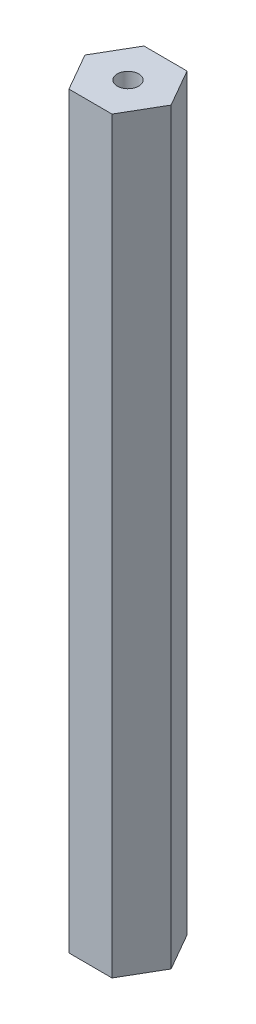
ISO-10303-21;
HEADER;
FILE_DESCRIPTION(('STEP AP214'),'2;1');
FILE_NAME('part.step','',(''),(''),'','','');
FILE_SCHEMA(('AUTOMOTIVE_DESIGN { 1 0 10303 214 1 1 1 1 }'));
ENDSEC;
DATA;
#1=APPLICATION_CONTEXT('core data for automotive mechanical design processes');
#2=APPLICATION_PROTOCOL_DEFINITION('international standard','automotive_design',2000,#1);
#3=PRODUCT_CONTEXT('',#1,'mechanical');
#4=PRODUCT('Part','Part','',(#3));
#5=PRODUCT_RELATED_PRODUCT_CATEGORY('part','',(#4));
#6=PRODUCT_DEFINITION_FORMATION('','',#4);
#7=PRODUCT_DEFINITION_CONTEXT('part definition',#1,'design');
#8=PRODUCT_DEFINITION('design','',#6,#7);
#9=PRODUCT_DEFINITION_SHAPE('','',#8);
#10=(LENGTH_UNIT() NAMED_UNIT(*) SI_UNIT(.MILLI.,.METRE.));
#11=(NAMED_UNIT(*) PLANE_ANGLE_UNIT() SI_UNIT($,.RADIAN.));
#12=(NAMED_UNIT(*) SI_UNIT($,.STERADIAN.) SOLID_ANGLE_UNIT());
#13=UNCERTAINTY_MEASURE_WITH_UNIT(LENGTH_MEASURE(1.E-05),#10,'distance_accuracy_value','');
#14=(GEOMETRIC_REPRESENTATION_CONTEXT(3) GLOBAL_UNCERTAINTY_ASSIGNED_CONTEXT((#13)) GLOBAL_UNIT_ASSIGNED_CONTEXT((#10,
#11,#12)) REPRESENTATION_CONTEXT('',''));
#15=CARTESIAN_POINT('',(0.,0.,0.));
#16=DIRECTION('',(0.,0.,1.));
#17=DIRECTION('',(1.,0.,0.));
#18=AXIS2_PLACEMENT_3D('',#15,#16,#17);
#19=CARTESIAN_POINT('',(0.,88.9,0.));
#20=DIRECTION('',(0.,1.,0.));
#21=DIRECTION('',(0.,0.,1.));
#22=AXIS2_PLACEMENT_3D('',#19,#20,#21);
#23=PLANE('',#22);
#24=DIRECTION('',(0.999994818263822,0.,0.00321923057656727));
#25=VECTOR('',#24,1.);
#26=CARTESIAN_POINT('',(-2.58061812845745,88.9,4.43671538510305));
#27=LINE('',#26,#25);
#28=CARTESIAN_POINT('',(-2.58061812845745,88.9,4.43671538510305));
#29=VERTEX_POINT('',#28);
#30=CARTESIAN_POINT('',(2.55199916863177,88.9,4.45323854926233));
#31=VERTEX_POINT('',#30);
#32=EDGE_CURVE('E146',#29,#31,#27,.T.);
#33=ORIENTED_EDGE('',*,*,#32,.T.);
#34=DIRECTION('',(0.502785344591858,0.,-0.864411300980989));
#35=VECTOR('',#34,1.);
#36=CARTESIAN_POINT('',(2.55199916863177,88.9,4.45323854926233));
#37=LINE('',#36,#35);
#38=CARTESIAN_POINT('',(5.13261729708923,88.9,0.0165231641592834));
#39=VERTEX_POINT('',#38);
#40=EDGE_CURVE('E94',#31,#39,#37,.T.);
#41=ORIENTED_EDGE('',*,*,#40,.T.);
#42=DIRECTION('',(-0.497209473671965,0.,-0.867630531557556));
#43=VECTOR('',#42,1.);
#44=CARTESIAN_POINT('',(5.13261729708923,88.9,0.0165231641592834));
#45=LINE('',#44,#43);
#46=CARTESIAN_POINT('',(2.58061812845745,88.9,-4.43671538510305));
#47=VERTEX_POINT('',#46);
#48=EDGE_CURVE('E107',#39,#47,#45,.T.);
#49=ORIENTED_EDGE('',*,*,#48,.T.);
#50=DIRECTION('',(-0.999994818263822,0.,-0.0032192305765671));
#51=VECTOR('',#50,1.);
#52=CARTESIAN_POINT('',(2.58061812845745,88.9,-4.43671538510305));
#53=LINE('',#52,#51);
#54=CARTESIAN_POINT('',(-2.55199916863177,88.9,-4.45323854926233));
#55=VERTEX_POINT('',#54);
#56=EDGE_CURVE('E101',#47,#55,#53,.T.);
#57=ORIENTED_EDGE('',*,*,#56,.T.);
#58=DIRECTION('',(-0.502785344591858,0.,0.864411300980989));
#59=VECTOR('',#58,1.);
#60=CARTESIAN_POINT('',(-2.55199916863177,88.9,-4.45323854926233));
#61=LINE('',#60,#59);
#62=CARTESIAN_POINT('',(-5.13261729708923,88.9,-0.0165231641592826));
#63=VERTEX_POINT('',#62);
#64=EDGE_CURVE('E105',#55,#63,#61,.T.);
#65=ORIENTED_EDGE('',*,*,#64,.T.);
#66=DIRECTION('',(0.497209473671965,0.,0.867630531557556));
#67=VECTOR('',#66,1.);
#68=CARTESIAN_POINT('',(-5.13261729708923,88.9,-0.0165231641592826));
#69=LINE('',#68,#67);
#70=EDGE_CURVE('E57',#63,#29,#69,.T.);
#71=ORIENTED_EDGE('',*,*,#70,.T.);
#72=EDGE_LOOP('',(#33,#41,#49,#57,#65,#71));
#73=FACE_BOUND('',#72,.T.);
#74=CARTESIAN_POINT('',(0.,88.9,0.));
#75=DIRECTION('',(0.,1.,0.));
#76=DIRECTION('',(0.,0.,1.));
#77=AXIS2_PLACEMENT_3D('',#74,#75,#76);
#78=CIRCLE('',#77,1.27);
#79=CARTESIAN_POINT('',(0.,88.9,1.27));
#80=VERTEX_POINT('',#79);
#81=EDGE_CURVE('E134',#80,#80,#78,.T.);
#82=ORIENTED_EDGE('',*,*,#81,.F.);
#83=EDGE_LOOP('',(#82));
#84=FACE_BOUND('',#83,.T.);
#85=ADVANCED_FACE('F39',(#73,#84),#23,.T.);
#86=CARTESIAN_POINT('',(0.,0.,0.));
#87=DIRECTION('',(0.,1.,0.));
#88=DIRECTION('',(0.,0.,1.));
#89=AXIS2_PLACEMENT_3D('',#86,#87,#88);
#90=PLANE('',#89);
#91=DIRECTION('',(0.999994818263822,0.,0.00321923057656727));
#92=VECTOR('',#91,1.);
#93=CARTESIAN_POINT('',(-2.58061812845745,0.,4.43671538510305));
#94=LINE('',#93,#92);
#95=CARTESIAN_POINT('',(-2.58061812845745,0.,4.43671538510305));
#96=VERTEX_POINT('',#95);
#97=CARTESIAN_POINT('',(2.55199916863177,0.,4.45323854926233));
#98=VERTEX_POINT('',#97);
#99=EDGE_CURVE('E129',#96,#98,#94,.T.);
#100=ORIENTED_EDGE('',*,*,#99,.F.);
#101=DIRECTION('',(0.497209473671965,0.,0.867630531557556));
#102=VECTOR('',#101,1.);
#103=CARTESIAN_POINT('',(-5.13261729708923,0.,-0.0165231641592826));
#104=LINE('',#103,#102);
#105=CARTESIAN_POINT('',(-5.13261729708923,0.,-0.0165231641592826));
#106=VERTEX_POINT('',#105);
#107=EDGE_CURVE('E86',#106,#96,#104,.T.);
#108=ORIENTED_EDGE('',*,*,#107,.F.);
#109=DIRECTION('',(-0.502785344591858,0.,0.864411300980989));
#110=VECTOR('',#109,1.);
#111=CARTESIAN_POINT('',(-2.55199916863177,0.,-4.45323854926233));
#112=LINE('',#111,#110);
#113=CARTESIAN_POINT('',(-2.55199916863177,0.,-4.45323854926233));
#114=VERTEX_POINT('',#113);
#115=EDGE_CURVE('E80',#114,#106,#112,.T.);
#116=ORIENTED_EDGE('',*,*,#115,.F.);
#117=DIRECTION('',(-0.999994818263822,0.,-0.0032192305765671));
#118=VECTOR('',#117,1.);
#119=CARTESIAN_POINT('',(2.58061812845745,0.,-4.43671538510305));
#120=LINE('',#119,#118);
#121=CARTESIAN_POINT('',(2.58061812845745,0.,-4.43671538510305));
#122=VERTEX_POINT('',#121);
#123=EDGE_CURVE('E116',#122,#114,#120,.T.);
#124=ORIENTED_EDGE('',*,*,#123,.F.);
#125=DIRECTION('',(-0.497209473671965,0.,-0.867630531557556));
#126=VECTOR('',#125,1.);
#127=CARTESIAN_POINT('',(5.13261729708923,0.,0.0165231641592834));
#128=LINE('',#127,#126);
#129=CARTESIAN_POINT('',(5.13261729708923,0.,0.0165231641592834));
#130=VERTEX_POINT('',#129);
#131=EDGE_CURVE('E137',#130,#122,#128,.T.);
#132=ORIENTED_EDGE('',*,*,#131,.F.);
#133=DIRECTION('',(0.502785344591858,0.,-0.864411300980989));
#134=VECTOR('',#133,1.);
#135=CARTESIAN_POINT('',(2.55199916863177,0.,4.45323854926233));
#136=LINE('',#135,#134);
#137=EDGE_CURVE('E133',#98,#130,#136,.T.);
#138=ORIENTED_EDGE('',*,*,#137,.F.);
#139=EDGE_LOOP('',(#100,#108,#116,#124,#132,#138));
#140=FACE_BOUND('',#139,.T.);
#141=CARTESIAN_POINT('',(0.,0.,0.));
#142=DIRECTION('',(0.,1.,0.));
#143=DIRECTION('',(0.,0.,1.));
#144=AXIS2_PLACEMENT_3D('',#141,#142,#143);
#145=CIRCLE('',#144,1.27);
#146=CARTESIAN_POINT('',(0.,0.,1.27));
#147=VERTEX_POINT('',#146);
#148=EDGE_CURVE('E243',#147,#147,#145,.T.);
#149=ORIENTED_EDGE('',*,*,#148,.T.);
#150=EDGE_LOOP('',(#149));
#151=FACE_BOUND('',#150,.T.);
#152=ADVANCED_FACE('F159',(#140,#151),#90,.F.);
#153=CARTESIAN_POINT('',(-2.58061812845745,88.9,4.43671538510305));
#154=DIRECTION('',(0.00321923057656727,0.,-0.999994818263822));
#155=DIRECTION('',(-0.999994818263822,0.,-0.00321923057656727));
#156=AXIS2_PLACEMENT_3D('',#153,#154,#155);
#157=PLANE('',#156);
#158=ORIENTED_EDGE('',*,*,#99,.T.);
#159=DIRECTION('',(0.,-1.,0.));
#160=VECTOR('',#159,1.);
#161=CARTESIAN_POINT('',(2.55199916863177,88.9,4.45323854926233));
#162=LINE('',#161,#160);
#163=EDGE_CURVE('E11',#31,#98,#162,.T.);
#164=ORIENTED_EDGE('',*,*,#163,.F.);
#165=ORIENTED_EDGE('',*,*,#32,.F.);
#166=DIRECTION('',(0.,-1.,0.));
#167=VECTOR('',#166,1.);
#168=CARTESIAN_POINT('',(-2.58061812845745,88.9,4.43671538510305));
#169=LINE('',#168,#167);
#170=EDGE_CURVE('E125',#29,#96,#169,.T.);
#171=ORIENTED_EDGE('',*,*,#170,.T.);
#172=EDGE_LOOP('',(#158,#164,#165,#171));
#173=FACE_BOUND('',#172,.T.);
#174=ADVANCED_FACE('F41',(#173),#157,.F.);
#175=CARTESIAN_POINT('',(2.55199916863177,88.9,4.45323854926233));
#176=DIRECTION('',(-0.864411300980989,0.,-0.502785344591858));
#177=DIRECTION('',(-0.502785344591858,0.,0.864411300980989));
#178=AXIS2_PLACEMENT_3D('',#175,#176,#177);
#179=PLANE('',#178);
#180=ORIENTED_EDGE('',*,*,#137,.T.);
#181=DIRECTION('',(0.,-1.,0.));
#182=VECTOR('',#181,1.);
#183=CARTESIAN_POINT('',(5.13261729708923,88.9,0.0165231641592834));
#184=LINE('',#183,#182);
#185=EDGE_CURVE('E49',#39,#130,#184,.T.);
#186=ORIENTED_EDGE('',*,*,#185,.F.);
#187=ORIENTED_EDGE('',*,*,#40,.F.);
#188=ORIENTED_EDGE('',*,*,#163,.T.);
#189=EDGE_LOOP('',(#180,#186,#187,#188));
#190=FACE_BOUND('',#189,.T.);
#191=ADVANCED_FACE('F184',(#190),#179,.F.);
#192=CARTESIAN_POINT('',(5.13261729708923,88.9,0.0165231641592834));
#193=DIRECTION('',(-0.867630531557556,0.,0.497209473671965));
#194=DIRECTION('',(0.497209473671965,0.,0.867630531557557));
#195=AXIS2_PLACEMENT_3D('',#192,#193,#194);
#196=PLANE('',#195);
#197=ORIENTED_EDGE('',*,*,#131,.T.);
#198=DIRECTION('',(0.,-1.,0.));
#199=VECTOR('',#198,1.);
#200=CARTESIAN_POINT('',(2.58061812845745,88.9,-4.43671538510305));
#201=LINE('',#200,#199);
#202=EDGE_CURVE('E118',#47,#122,#201,.T.);
#203=ORIENTED_EDGE('',*,*,#202,.F.);
#204=ORIENTED_EDGE('',*,*,#48,.F.);
#205=ORIENTED_EDGE('',*,*,#185,.T.);
#206=EDGE_LOOP('',(#197,#203,#204,#205));
#207=FACE_BOUND('',#206,.T.);
#208=ADVANCED_FACE('F156',(#207),#196,.F.);
#209=CARTESIAN_POINT('',(2.58061812845745,88.9,-4.43671538510305));
#210=DIRECTION('',(-0.0032192305765671,0.,0.999994818263822));
#211=DIRECTION('',(0.999994818263822,0.,0.0032192305765671));
#212=AXIS2_PLACEMENT_3D('',#209,#210,#211);
#213=PLANE('',#212);
#214=ORIENTED_EDGE('',*,*,#123,.T.);
#215=DIRECTION('',(0.,-1.,0.));
#216=VECTOR('',#215,1.);
#217=CARTESIAN_POINT('',(-2.55199916863177,88.9,-4.45323854926233));
#218=LINE('',#217,#216);
#219=EDGE_CURVE('E113',#55,#114,#218,.T.);
#220=ORIENTED_EDGE('',*,*,#219,.F.);
#221=ORIENTED_EDGE('',*,*,#56,.F.);
#222=ORIENTED_EDGE('',*,*,#202,.T.);
#223=EDGE_LOOP('',(#214,#220,#221,#222));
#224=FACE_BOUND('',#223,.T.);
#225=ADVANCED_FACE('F114',(#224),#213,.F.);
#226=CARTESIAN_POINT('',(-2.55199916863177,88.9,-4.45323854926233));
#227=DIRECTION('',(0.864411300980989,0.,0.502785344591858));
#228=DIRECTION('',(0.502785344591858,0.,-0.86441130098099));
#229=AXIS2_PLACEMENT_3D('',#226,#227,#228);
#230=PLANE('',#229);
#231=ORIENTED_EDGE('',*,*,#115,.T.);
#232=DIRECTION('',(0.,-1.,0.));
#233=VECTOR('',#232,1.);
#234=CARTESIAN_POINT('',(-5.13261729708923,88.9,-0.0165231641592826));
#235=LINE('',#234,#233);
#236=EDGE_CURVE('E119',#63,#106,#235,.T.);
#237=ORIENTED_EDGE('',*,*,#236,.F.);
#238=ORIENTED_EDGE('',*,*,#64,.F.);
#239=ORIENTED_EDGE('',*,*,#219,.T.);
#240=EDGE_LOOP('',(#231,#237,#238,#239));
#241=FACE_BOUND('',#240,.T.);
#242=ADVANCED_FACE('F121',(#241),#230,.F.);
#243=CARTESIAN_POINT('',(-5.13261729708923,88.9,-0.0165231641592826));
#244=DIRECTION('',(0.867630531557556,0.,-0.497209473671965));
#245=DIRECTION('',(-0.497209473671965,0.,-0.867630531557556));
#246=AXIS2_PLACEMENT_3D('',#243,#244,#245);
#247=PLANE('',#246);
#248=ORIENTED_EDGE('',*,*,#107,.T.);
#249=ORIENTED_EDGE('',*,*,#170,.F.);
#250=ORIENTED_EDGE('',*,*,#70,.F.);
#251=ORIENTED_EDGE('',*,*,#236,.T.);
#252=EDGE_LOOP('',(#248,#249,#250,#251));
#253=FACE_BOUND('',#252,.T.);
#254=ADVANCED_FACE('F164',(#253),#247,.F.);
#255=CARTESIAN_POINT('',(0.,88.9,0.));
#256=DIRECTION('',(0.,-1.,0.));
#257=DIRECTION('',(0.,0.,-1.));
#258=AXIS2_PLACEMENT_3D('',#255,#256,#257);
#259=CYLINDRICAL_SURFACE('',#258,1.27);
#260=ORIENTED_EDGE('',*,*,#81,.T.);
#261=EDGE_LOOP('',(#260));
#262=FACE_BOUND('',#261,.T.);
#263=ORIENTED_EDGE('',*,*,#148,.F.);
#264=EDGE_LOOP('',(#263));
#265=FACE_BOUND('',#264,.T.);
#266=ADVANCED_FACE('F166',(#262,#265),#259,.F.);
#267=CLOSED_SHELL('',(#85,#152,#174,#191,#208,#225,#242,#254,#266));
#268=MANIFOLD_SOLID_BREP('B2',#267);
#269=ADVANCED_BREP_SHAPE_REPRESENTATION('',(#18,#268),#14);
#270=SHAPE_DEFINITION_REPRESENTATION(#9,#269);
ENDSEC;
END-ISO-10303-21;
